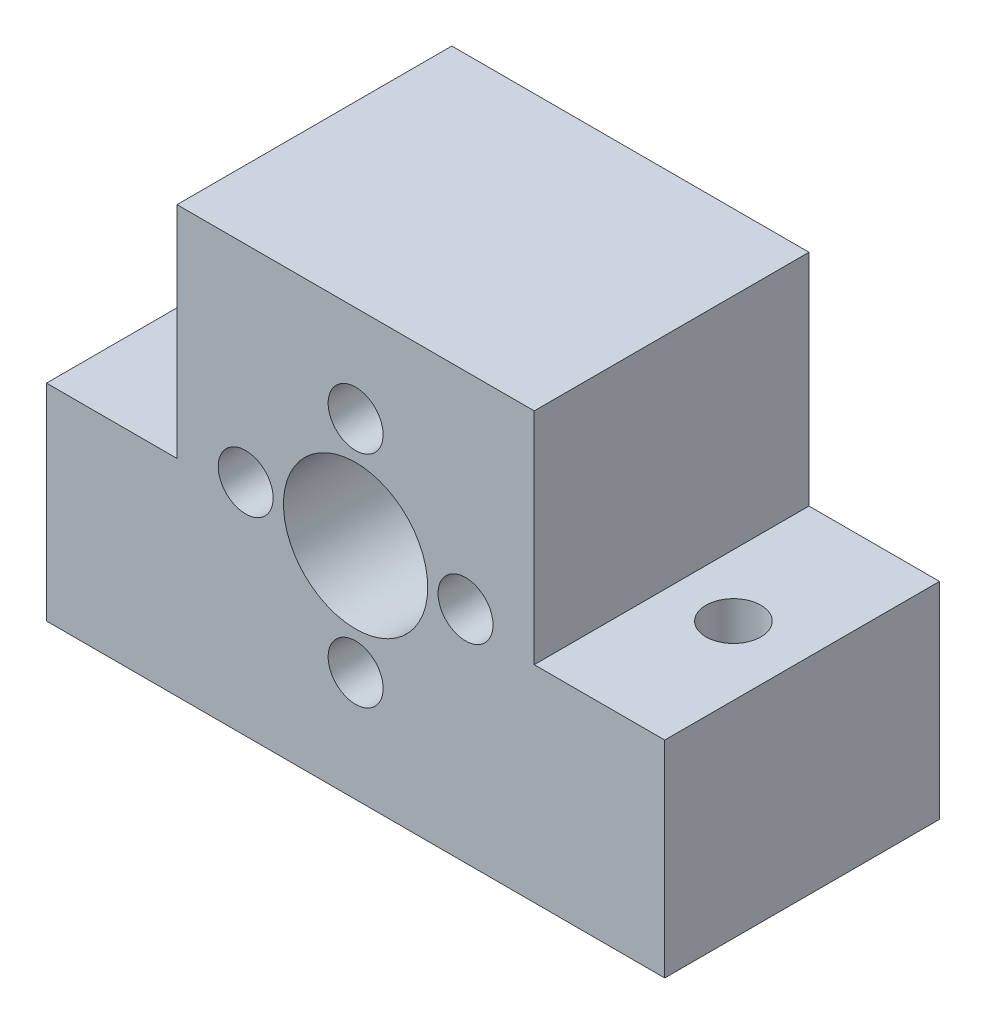
ISO-10303-21;
HEADER;
FILE_DESCRIPTION(('STEP AP214'),'2;1');
FILE_NAME('part.step','',(''),(''),'','','');
FILE_SCHEMA(('AUTOMOTIVE_DESIGN { 1 0 10303 214 1 1 1 1 }'));
ENDSEC;
DATA;
#1=APPLICATION_CONTEXT('core data for automotive mechanical design processes');
#2=APPLICATION_PROTOCOL_DEFINITION('international standard','automotive_design',2000,#1);
#3=PRODUCT_CONTEXT('',#1,'mechanical');
#4=PRODUCT('Part','Part','',(#3));
#5=PRODUCT_RELATED_PRODUCT_CATEGORY('part','',(#4));
#6=PRODUCT_DEFINITION_FORMATION('','',#4);
#7=PRODUCT_DEFINITION_CONTEXT('part definition',#1,'design');
#8=PRODUCT_DEFINITION('design','',#6,#7);
#9=PRODUCT_DEFINITION_SHAPE('','',#8);
#10=(LENGTH_UNIT() NAMED_UNIT(*) SI_UNIT(.MILLI.,.METRE.));
#11=(NAMED_UNIT(*) PLANE_ANGLE_UNIT() SI_UNIT($,.RADIAN.));
#12=(NAMED_UNIT(*) SI_UNIT($,.STERADIAN.) SOLID_ANGLE_UNIT());
#13=UNCERTAINTY_MEASURE_WITH_UNIT(LENGTH_MEASURE(1.E-05),#10,'distance_accuracy_value','');
#14=(GEOMETRIC_REPRESENTATION_CONTEXT(3) GLOBAL_UNCERTAINTY_ASSIGNED_CONTEXT((#13)) GLOBAL_UNIT_ASSIGNED_CONTEXT((#10,
#11,#12)) REPRESENTATION_CONTEXT('',''));
#15=CARTESIAN_POINT('',(0.,0.,0.));
#16=DIRECTION('',(0.,0.,1.));
#17=DIRECTION('',(1.,0.,0.));
#18=AXIS2_PLACEMENT_3D('',#15,#16,#17);
#19=CARTESIAN_POINT('',(0.,0.,20.));
#20=DIRECTION('',(0.,0.,-1.));
#21=DIRECTION('',(-1.,0.,0.));
#22=AXIS2_PLACEMENT_3D('',#19,#20,#21);
#23=PLANE('',#22);
#24=CARTESIAN_POINT('',(-8.,0.,20.));
#25=DIRECTION('',(0.,0.,1.));
#26=DIRECTION('',(1.,0.,0.));
#27=AXIS2_PLACEMENT_3D('',#24,#25,#26);
#28=CIRCLE('',#27,2.);
#29=CARTESIAN_POINT('',(-6.,0.,20.));
#30=VERTEX_POINT('',#29);
#31=EDGE_CURVE('E172',#30,#30,#28,.T.);
#32=ORIENTED_EDGE('',*,*,#31,.F.);
#33=EDGE_LOOP('',(#32));
#34=FACE_BOUND('',#33,.T.);
#35=CARTESIAN_POINT('',(0.,-8.,20.));
#36=DIRECTION('',(0.,0.,1.));
#37=DIRECTION('',(1.,0.,0.));
#38=AXIS2_PLACEMENT_3D('',#35,#36,#37);
#39=CIRCLE('',#38,2.);
#40=CARTESIAN_POINT('',(1.99999999999994,-8.,20.));
#41=VERTEX_POINT('',#40);
#42=EDGE_CURVE('E178',#41,#41,#39,.T.);
#43=ORIENTED_EDGE('',*,*,#42,.F.);
#44=EDGE_LOOP('',(#43));
#45=FACE_BOUND('',#44,.T.);
#46=CARTESIAN_POINT('',(8.,0.,20.));
#47=DIRECTION('',(0.,0.,1.));
#48=DIRECTION('',(1.,0.,0.));
#49=AXIS2_PLACEMENT_3D('',#46,#47,#48);
#50=CIRCLE('',#49,2.);
#51=CARTESIAN_POINT('',(10.,0.,20.));
#52=VERTEX_POINT('',#51);
#53=EDGE_CURVE('E184',#52,#52,#50,.T.);
#54=ORIENTED_EDGE('',*,*,#53,.F.);
#55=EDGE_LOOP('',(#54));
#56=FACE_BOUND('',#55,.T.);
#57=CARTESIAN_POINT('',(0.,8.,20.));
#58=DIRECTION('',(0.,0.,1.));
#59=DIRECTION('',(1.,0.,0.));
#60=AXIS2_PLACEMENT_3D('',#57,#58,#59);
#61=CIRCLE('',#60,2.);
#62=CARTESIAN_POINT('',(2.,8.,20.));
#63=VERTEX_POINT('',#62);
#64=EDGE_CURVE('E190',#63,#63,#61,.T.);
#65=ORIENTED_EDGE('',*,*,#64,.F.);
#66=EDGE_LOOP('',(#65));
#67=FACE_BOUND('',#66,.T.);
#68=CARTESIAN_POINT('',(0.,0.,20.));
#69=DIRECTION('',(0.,0.,1.));
#70=DIRECTION('',(1.,0.,0.));
#71=AXIS2_PLACEMENT_3D('',#68,#69,#70);
#72=CIRCLE('',#71,5.25);
#73=CARTESIAN_POINT('',(5.25,0.,20.));
#74=VERTEX_POINT('',#73);
#75=EDGE_CURVE('E131',#74,#74,#72,.T.);
#76=ORIENTED_EDGE('',*,*,#75,.F.);
#77=EDGE_LOOP('',(#76));
#78=FACE_BOUND('',#77,.T.);
#79=DIRECTION('',(1.,0.,0.));
#80=VECTOR('',#79,1.);
#81=CARTESIAN_POINT('',(0.,-1.,20.));
#82=LINE('',#81,#80);
#83=CARTESIAN_POINT('',(-22.5,-1.,20.));
#84=VERTEX_POINT('',#83);
#85=CARTESIAN_POINT('',(-13.,-1.,20.));
#86=VERTEX_POINT('',#85);
#87=EDGE_CURVE('E102',#84,#86,#82,.T.);
#88=ORIENTED_EDGE('',*,*,#87,.F.);
#89=DIRECTION('',(0.,-1.,0.));
#90=VECTOR('',#89,1.);
#91=CARTESIAN_POINT('',(-22.5,-16.,20.));
#92=LINE('',#91,#90);
#93=CARTESIAN_POINT('',(-22.5,-16.,20.));
#94=VERTEX_POINT('',#93);
#95=EDGE_CURVE('E112',#84,#94,#92,.T.);
#96=ORIENTED_EDGE('',*,*,#95,.T.);
#97=DIRECTION('',(1.,0.,0.));
#98=VECTOR('',#97,1.);
#99=CARTESIAN_POINT('',(-22.5,-16.,20.));
#100=LINE('',#99,#98);
#101=CARTESIAN_POINT('',(22.5,-16.,20.));
#102=VERTEX_POINT('',#101);
#103=EDGE_CURVE('E119',#94,#102,#100,.T.);
#104=ORIENTED_EDGE('',*,*,#103,.T.);
#105=DIRECTION('',(0.,1.,0.));
#106=VECTOR('',#105,1.);
#107=CARTESIAN_POINT('',(22.5,-16.,20.));
#108=LINE('',#107,#106);
#109=CARTESIAN_POINT('',(22.5,-1.,20.));
#110=VERTEX_POINT('',#109);
#111=EDGE_CURVE('E123',#102,#110,#108,.T.);
#112=ORIENTED_EDGE('',*,*,#111,.T.);
#113=DIRECTION('',(-1.,0.,0.));
#114=VECTOR('',#113,1.);
#115=CARTESIAN_POINT('',(0.,-1.,20.));
#116=LINE('',#115,#114);
#117=CARTESIAN_POINT('',(13.,-1.,20.));
#118=VERTEX_POINT('',#117);
#119=EDGE_CURVE('E150',#110,#118,#116,.T.);
#120=ORIENTED_EDGE('',*,*,#119,.T.);
#121=DIRECTION('',(0.,1.,0.));
#122=VECTOR('',#121,1.);
#123=CARTESIAN_POINT('',(13.,0.,20.));
#124=LINE('',#123,#122);
#125=CARTESIAN_POINT('',(13.,15.,20.));
#126=VERTEX_POINT('',#125);
#127=EDGE_CURVE('E153',#118,#126,#124,.T.);
#128=ORIENTED_EDGE('',*,*,#127,.T.);
#129=DIRECTION('',(-1.,0.,0.));
#130=VECTOR('',#129,1.);
#131=CARTESIAN_POINT('',(-22.5,15.,20.));
#132=LINE('',#131,#130);
#133=CARTESIAN_POINT('',(-13.,15.,20.));
#134=VERTEX_POINT('',#133);
#135=EDGE_CURVE('E120',#126,#134,#132,.T.);
#136=ORIENTED_EDGE('',*,*,#135,.T.);
#137=DIRECTION('',(0.,1.,0.));
#138=VECTOR('',#137,1.);
#139=CARTESIAN_POINT('',(-13.,0.,20.));
#140=LINE('',#139,#138);
#141=EDGE_CURVE('E108',#86,#134,#140,.T.);
#142=ORIENTED_EDGE('',*,*,#141,.F.);
#143=EDGE_LOOP('',(#88,#96,#104,#112,#120,#128,#136,#142));
#144=FACE_BOUND('',#143,.T.);
#145=ADVANCED_FACE('F33',(#34,#45,#56,#67,#78,#144),#23,.F.);
#146=CARTESIAN_POINT('',(0.,0.,0.));
#147=DIRECTION('',(0.,0.,-1.));
#148=DIRECTION('',(-1.,0.,0.));
#149=AXIS2_PLACEMENT_3D('',#146,#147,#148);
#150=PLANE('',#149);
#151=CARTESIAN_POINT('',(0.,-8.,0.));
#152=DIRECTION('',(0.,0.,1.));
#153=DIRECTION('',(1.,0.,0.));
#154=AXIS2_PLACEMENT_3D('',#151,#152,#153);
#155=CIRCLE('',#154,2.);
#156=CARTESIAN_POINT('',(1.99999999999994,-8.,0.));
#157=VERTEX_POINT('',#156);
#158=EDGE_CURVE('E175',#157,#157,#155,.T.);
#159=ORIENTED_EDGE('',*,*,#158,.T.);
#160=EDGE_LOOP('',(#159));
#161=FACE_BOUND('',#160,.T.);
#162=CARTESIAN_POINT('',(0.,8.,0.));
#163=DIRECTION('',(0.,0.,1.));
#164=DIRECTION('',(1.,0.,0.));
#165=AXIS2_PLACEMENT_3D('',#162,#163,#164);
#166=CIRCLE('',#165,2.);
#167=CARTESIAN_POINT('',(2.,8.,0.));
#168=VERTEX_POINT('',#167);
#169=EDGE_CURVE('E187',#168,#168,#166,.T.);
#170=ORIENTED_EDGE('',*,*,#169,.T.);
#171=EDGE_LOOP('',(#170));
#172=FACE_BOUND('',#171,.T.);
#173=CARTESIAN_POINT('',(0.,0.,0.));
#174=DIRECTION('',(0.,0.,1.));
#175=DIRECTION('',(1.,0.,0.));
#176=AXIS2_PLACEMENT_3D('',#173,#174,#175);
#177=CIRCLE('',#176,5.25);
#178=CARTESIAN_POINT('',(5.25,0.,0.));
#179=VERTEX_POINT('',#178);
#180=EDGE_CURVE('E193',#179,#179,#177,.T.);
#181=ORIENTED_EDGE('',*,*,#180,.T.);
#182=EDGE_LOOP('',(#181));
#183=FACE_BOUND('',#182,.T.);
#184=CARTESIAN_POINT('',(8.,0.,0.));
#185=DIRECTION('',(0.,0.,1.));
#186=DIRECTION('',(1.,0.,0.));
#187=AXIS2_PLACEMENT_3D('',#184,#185,#186);
#188=CIRCLE('',#187,2.);
#189=CARTESIAN_POINT('',(10.,0.,0.));
#190=VERTEX_POINT('',#189);
#191=EDGE_CURVE('E181',#190,#190,#188,.T.);
#192=ORIENTED_EDGE('',*,*,#191,.T.);
#193=EDGE_LOOP('',(#192));
#194=FACE_BOUND('',#193,.T.);
#195=CARTESIAN_POINT('',(-8.,0.,0.));
#196=DIRECTION('',(0.,0.,1.));
#197=DIRECTION('',(1.,0.,0.));
#198=AXIS2_PLACEMENT_3D('',#195,#196,#197);
#199=CIRCLE('',#198,2.);
#200=CARTESIAN_POINT('',(-6.,0.,0.));
#201=VERTEX_POINT('',#200);
#202=EDGE_CURVE('E169',#201,#201,#199,.T.);
#203=ORIENTED_EDGE('',*,*,#202,.T.);
#204=EDGE_LOOP('',(#203));
#205=FACE_BOUND('',#204,.T.);
#206=DIRECTION('',(0.,-1.,0.));
#207=VECTOR('',#206,1.);
#208=CARTESIAN_POINT('',(-22.5,-16.,0.));
#209=LINE('',#208,#207);
#210=CARTESIAN_POINT('',(-22.5,-1.,0.));
#211=VERTEX_POINT('',#210);
#212=CARTESIAN_POINT('',(-22.5,-16.,0.));
#213=VERTEX_POINT('',#212);
#214=EDGE_CURVE('E134',#211,#213,#209,.T.);
#215=ORIENTED_EDGE('',*,*,#214,.F.);
#216=DIRECTION('',(1.,0.,0.));
#217=VECTOR('',#216,1.);
#218=CARTESIAN_POINT('',(0.,-1.,0.));
#219=LINE('',#218,#217);
#220=CARTESIAN_POINT('',(-13.,-1.,0.));
#221=VERTEX_POINT('',#220);
#222=EDGE_CURVE('E58',#211,#221,#219,.T.);
#223=ORIENTED_EDGE('',*,*,#222,.T.);
#224=DIRECTION('',(0.,1.,0.));
#225=VECTOR('',#224,1.);
#226=CARTESIAN_POINT('',(-13.,0.,0.));
#227=LINE('',#226,#225);
#228=CARTESIAN_POINT('',(-13.,15.,0.));
#229=VERTEX_POINT('',#228);
#230=EDGE_CURVE('E115',#221,#229,#227,.T.);
#231=ORIENTED_EDGE('',*,*,#230,.T.);
#232=DIRECTION('',(-1.,0.,0.));
#233=VECTOR('',#232,1.);
#234=CARTESIAN_POINT('',(-22.5,15.,0.));
#235=LINE('',#234,#233);
#236=CARTESIAN_POINT('',(13.,15.,0.));
#237=VERTEX_POINT('',#236);
#238=EDGE_CURVE('E130',#237,#229,#235,.T.);
#239=ORIENTED_EDGE('',*,*,#238,.F.);
#240=DIRECTION('',(0.,1.,0.));
#241=VECTOR('',#240,1.);
#242=CARTESIAN_POINT('',(13.,0.,0.));
#243=LINE('',#242,#241);
#244=CARTESIAN_POINT('',(13.,-1.,0.));
#245=VERTEX_POINT('',#244);
#246=EDGE_CURVE('E50',#245,#237,#243,.T.);
#247=ORIENTED_EDGE('',*,*,#246,.F.);
#248=DIRECTION('',(-1.,0.,0.));
#249=VECTOR('',#248,1.);
#250=CARTESIAN_POINT('',(0.,-1.,0.));
#251=LINE('',#250,#249);
#252=CARTESIAN_POINT('',(22.5,-1.,0.));
#253=VERTEX_POINT('',#252);
#254=EDGE_CURVE('E157',#253,#245,#251,.T.);
#255=ORIENTED_EDGE('',*,*,#254,.F.);
#256=DIRECTION('',(0.,1.,0.));
#257=VECTOR('',#256,1.);
#258=CARTESIAN_POINT('',(22.5,-16.,0.));
#259=LINE('',#258,#257);
#260=CARTESIAN_POINT('',(22.5,-16.,0.));
#261=VERTEX_POINT('',#260);
#262=EDGE_CURVE('E127',#261,#253,#259,.T.);
#263=ORIENTED_EDGE('',*,*,#262,.F.);
#264=DIRECTION('',(1.,0.,0.));
#265=VECTOR('',#264,1.);
#266=CARTESIAN_POINT('',(-22.5,-16.,0.));
#267=LINE('',#266,#265);
#268=EDGE_CURVE('E136',#213,#261,#267,.T.);
#269=ORIENTED_EDGE('',*,*,#268,.F.);
#270=EDGE_LOOP('',(#215,#223,#231,#239,#247,#255,#263,#269));
#271=FACE_BOUND('',#270,.T.);
#272=ADVANCED_FACE('F210',(#161,#172,#183,#194,#205,#271),#150,.T.);
#273=CARTESIAN_POINT('',(-22.5,15.,20.));
#274=DIRECTION('',(0.,-1.,0.));
#275=DIRECTION('',(0.,0.,-1.));
#276=AXIS2_PLACEMENT_3D('',#273,#274,#275);
#277=PLANE('',#276);
#278=DIRECTION('',(0.,0.,-1.));
#279=VECTOR('',#278,1.);
#280=CARTESIAN_POINT('',(-13.,15.,20.));
#281=LINE('',#280,#279);
#282=EDGE_CURVE('E107',#134,#229,#281,.T.);
#283=ORIENTED_EDGE('',*,*,#282,.F.);
#284=ORIENTED_EDGE('',*,*,#135,.F.);
#285=DIRECTION('',(0.,0.,-1.));
#286=VECTOR('',#285,1.);
#287=CARTESIAN_POINT('',(13.,15.,20.));
#288=LINE('',#287,#286);
#289=EDGE_CURVE('E163',#126,#237,#288,.T.);
#290=ORIENTED_EDGE('',*,*,#289,.T.);
#291=ORIENTED_EDGE('',*,*,#238,.T.);
#292=EDGE_LOOP('',(#283,#284,#290,#291));
#293=FACE_BOUND('',#292,.T.);
#294=ADVANCED_FACE('F216',(#293),#277,.F.);
#295=CARTESIAN_POINT('',(-22.5,-16.,20.));
#296=DIRECTION('',(1.,0.,0.));
#297=DIRECTION('',(0.,0.,-1.));
#298=AXIS2_PLACEMENT_3D('',#295,#296,#297);
#299=PLANE('',#298);
#300=DIRECTION('',(0.,0.,-1.));
#301=VECTOR('',#300,1.);
#302=CARTESIAN_POINT('',(-22.5,-1.,20.));
#303=LINE('',#302,#301);
#304=EDGE_CURVE('E98',#84,#211,#303,.T.);
#305=ORIENTED_EDGE('',*,*,#304,.T.);
#306=ORIENTED_EDGE('',*,*,#214,.T.);
#307=DIRECTION('',(0.,0.,-1.));
#308=VECTOR('',#307,1.);
#309=CARTESIAN_POINT('',(-22.5,-16.,20.));
#310=LINE('',#309,#308);
#311=EDGE_CURVE('E11',#94,#213,#310,.T.);
#312=ORIENTED_EDGE('',*,*,#311,.F.);
#313=ORIENTED_EDGE('',*,*,#95,.F.);
#314=EDGE_LOOP('',(#305,#306,#312,#313));
#315=FACE_BOUND('',#314,.T.);
#316=ADVANCED_FACE('F117',(#315),#299,.F.);
#317=CARTESIAN_POINT('',(-17.5,-16.,10.));
#318=DIRECTION('',(0.,1.,0.));
#319=DIRECTION('',(0.,0.,1.));
#320=AXIS2_PLACEMENT_3D('',#317,#318,#319);
#321=CYLINDRICAL_SURFACE('',#320,2.);
#322=CARTESIAN_POINT('',(-17.5,-16.,10.));
#323=DIRECTION('',(0.,1.,0.));
#324=DIRECTION('',(0.,0.,1.));
#325=AXIS2_PLACEMENT_3D('',#322,#323,#324);
#326=CIRCLE('',#325,2.);
#327=CARTESIAN_POINT('',(-17.5,-16.,12.));
#328=VERTEX_POINT('',#327);
#329=EDGE_CURVE('E166',#328,#328,#326,.T.);
#330=ORIENTED_EDGE('',*,*,#329,.F.);
#331=EDGE_LOOP('',(#330));
#332=FACE_BOUND('',#331,.T.);
#333=CARTESIAN_POINT('',(-17.5,-1.,10.));
#334=DIRECTION('',(0.,1.,0.));
#335=DIRECTION('',(0.,0.,1.));
#336=AXIS2_PLACEMENT_3D('',#333,#334,#335);
#337=CIRCLE('',#336,2.);
#338=CARTESIAN_POINT('',(-17.5,-1.,12.));
#339=VERTEX_POINT('',#338);
#340=EDGE_CURVE('E139',#339,#339,#337,.F.);
#341=ORIENTED_EDGE('',*,*,#340,.F.);
#342=EDGE_LOOP('',(#341));
#343=FACE_BOUND('',#342,.T.);
#344=ADVANCED_FACE('F247',(#332,#343),#321,.F.);
#345=CARTESIAN_POINT('',(22.5,-16.,20.));
#346=DIRECTION('',(-1.,0.,0.));
#347=DIRECTION('',(0.,0.,1.));
#348=AXIS2_PLACEMENT_3D('',#345,#346,#347);
#349=PLANE('',#348);
#350=ORIENTED_EDGE('',*,*,#262,.T.);
#351=DIRECTION('',(0.,0.,-1.));
#352=VECTOR('',#351,1.);
#353=CARTESIAN_POINT('',(22.5,-1.,20.));
#354=LINE('',#353,#352);
#355=EDGE_CURVE('E161',#110,#253,#354,.T.);
#356=ORIENTED_EDGE('',*,*,#355,.F.);
#357=ORIENTED_EDGE('',*,*,#111,.F.);
#358=DIRECTION('',(0.,0.,-1.));
#359=VECTOR('',#358,1.);
#360=CARTESIAN_POINT('',(22.5,-16.,20.));
#361=LINE('',#360,#359);
#362=EDGE_CURVE('E42',#102,#261,#361,.T.);
#363=ORIENTED_EDGE('',*,*,#362,.T.);
#364=EDGE_LOOP('',(#350,#356,#357,#363));
#365=FACE_BOUND('',#364,.T.);
#366=ADVANCED_FACE('F35',(#365),#349,.F.);
#367=CARTESIAN_POINT('',(-22.5,-16.,20.));
#368=DIRECTION('',(0.,1.,0.));
#369=DIRECTION('',(-1.,0.,0.));
#370=AXIS2_PLACEMENT_3D('',#367,#368,#369);
#371=PLANE('',#370);
#372=ORIENTED_EDGE('',*,*,#329,.T.);
#373=EDGE_LOOP('',(#372));
#374=FACE_BOUND('',#373,.T.);
#375=CARTESIAN_POINT('',(17.5,-16.,10.));
#376=DIRECTION('',(0.,1.,0.));
#377=DIRECTION('',(0.,0.,-1.));
#378=AXIS2_PLACEMENT_3D('',#375,#376,#377);
#379=CIRCLE('',#378,2.);
#380=CARTESIAN_POINT('',(17.5,-16.,8.));
#381=VERTEX_POINT('',#380);
#382=EDGE_CURVE('E144',#381,#381,#379,.T.);
#383=ORIENTED_EDGE('',*,*,#382,.T.);
#384=EDGE_LOOP('',(#383));
#385=FACE_BOUND('',#384,.T.);
#386=ORIENTED_EDGE('',*,*,#268,.T.);
#387=ORIENTED_EDGE('',*,*,#362,.F.);
#388=ORIENTED_EDGE('',*,*,#103,.F.);
#389=ORIENTED_EDGE('',*,*,#311,.T.);
#390=EDGE_LOOP('',(#386,#387,#388,#389));
#391=FACE_BOUND('',#390,.T.);
#392=ADVANCED_FACE('F242',(#374,#385,#391),#371,.F.);
#393=CARTESIAN_POINT('',(0.,0.,20.));
#394=DIRECTION('',(0.,0.,-1.));
#395=DIRECTION('',(-1.,0.,0.));
#396=AXIS2_PLACEMENT_3D('',#393,#394,#395);
#397=CYLINDRICAL_SURFACE('',#396,5.25);
#398=ORIENTED_EDGE('',*,*,#75,.T.);
#399=EDGE_LOOP('',(#398));
#400=FACE_BOUND('',#399,.T.);
#401=ORIENTED_EDGE('',*,*,#180,.F.);
#402=EDGE_LOOP('',(#401));
#403=FACE_BOUND('',#402,.T.);
#404=ADVANCED_FACE('F239',(#400,#403),#397,.F.);
#405=CARTESIAN_POINT('',(0.,8.,20.));
#406=DIRECTION('',(0.,0.,-1.));
#407=DIRECTION('',(-1.,0.,0.));
#408=AXIS2_PLACEMENT_3D('',#405,#406,#407);
#409=CYLINDRICAL_SURFACE('',#408,2.);
#410=ORIENTED_EDGE('',*,*,#64,.T.);
#411=EDGE_LOOP('',(#410));
#412=FACE_BOUND('',#411,.T.);
#413=ORIENTED_EDGE('',*,*,#169,.F.);
#414=EDGE_LOOP('',(#413));
#415=FACE_BOUND('',#414,.T.);
#416=ADVANCED_FACE('F281',(#412,#415),#409,.F.);
#417=CARTESIAN_POINT('',(8.,0.,20.));
#418=DIRECTION('',(0.,0.,-1.));
#419=DIRECTION('',(-1.,0.,0.));
#420=AXIS2_PLACEMENT_3D('',#417,#418,#419);
#421=CYLINDRICAL_SURFACE('',#420,2.);
#422=ORIENTED_EDGE('',*,*,#53,.T.);
#423=EDGE_LOOP('',(#422));
#424=FACE_BOUND('',#423,.T.);
#425=ORIENTED_EDGE('',*,*,#191,.F.);
#426=EDGE_LOOP('',(#425));
#427=FACE_BOUND('',#426,.T.);
#428=ADVANCED_FACE('F288',(#424,#427),#421,.F.);
#429=CARTESIAN_POINT('',(0.,-8.,20.));
#430=DIRECTION('',(0.,0.,-1.));
#431=DIRECTION('',(-1.,0.,0.));
#432=AXIS2_PLACEMENT_3D('',#429,#430,#431);
#433=CYLINDRICAL_SURFACE('',#432,2.);
#434=ORIENTED_EDGE('',*,*,#42,.T.);
#435=EDGE_LOOP('',(#434));
#436=FACE_BOUND('',#435,.T.);
#437=ORIENTED_EDGE('',*,*,#158,.F.);
#438=EDGE_LOOP('',(#437));
#439=FACE_BOUND('',#438,.T.);
#440=ADVANCED_FACE('F295',(#436,#439),#433,.F.);
#441=CARTESIAN_POINT('',(-8.,0.,20.));
#442=DIRECTION('',(0.,0.,-1.));
#443=DIRECTION('',(-1.,0.,0.));
#444=AXIS2_PLACEMENT_3D('',#441,#442,#443);
#445=CYLINDRICAL_SURFACE('',#444,2.);
#446=ORIENTED_EDGE('',*,*,#31,.T.);
#447=EDGE_LOOP('',(#446));
#448=FACE_BOUND('',#447,.T.);
#449=ORIENTED_EDGE('',*,*,#202,.F.);
#450=EDGE_LOOP('',(#449));
#451=FACE_BOUND('',#450,.T.);
#452=ADVANCED_FACE('F303',(#448,#451),#445,.F.);
#453=CARTESIAN_POINT('',(17.5,-16.,10.));
#454=DIRECTION('',(0.,1.,0.));
#455=DIRECTION('',(0.,0.,1.));
#456=AXIS2_PLACEMENT_3D('',#453,#454,#455);
#457=CYLINDRICAL_SURFACE('',#456,2.);
#458=CARTESIAN_POINT('',(17.5,-1.,10.));
#459=DIRECTION('',(0.,-1.,0.));
#460=DIRECTION('',(0.,0.,-1.));
#461=AXIS2_PLACEMENT_3D('',#458,#459,#460);
#462=CIRCLE('',#461,2.);
#463=CARTESIAN_POINT('',(17.5,-1.,8.));
#464=VERTEX_POINT('',#463);
#465=EDGE_CURVE('E37',#464,#464,#462,.F.);
#466=ORIENTED_EDGE('',*,*,#465,.T.);
#467=EDGE_LOOP('',(#466));
#468=FACE_BOUND('',#467,.T.);
#469=ORIENTED_EDGE('',*,*,#382,.F.);
#470=EDGE_LOOP('',(#469));
#471=FACE_BOUND('',#470,.T.);
#472=ADVANCED_FACE('F310',(#468,#471),#457,.F.);
#473=CARTESIAN_POINT('',(0.,-1.,20.));
#474=DIRECTION('',(0.,1.,0.));
#475=DIRECTION('',(0.,0.,1.));
#476=AXIS2_PLACEMENT_3D('',#473,#474,#475);
#477=PLANE('',#476);
#478=ORIENTED_EDGE('',*,*,#222,.F.);
#479=ORIENTED_EDGE('',*,*,#304,.F.);
#480=ORIENTED_EDGE('',*,*,#87,.T.);
#481=DIRECTION('',(0.,0.,-1.));
#482=VECTOR('',#481,1.);
#483=CARTESIAN_POINT('',(-13.,-1.,20.));
#484=LINE('',#483,#482);
#485=EDGE_CURVE('E141',#86,#221,#484,.T.);
#486=ORIENTED_EDGE('',*,*,#485,.T.);
#487=EDGE_LOOP('',(#478,#479,#480,#486));
#488=FACE_BOUND('',#487,.T.);
#489=ORIENTED_EDGE('',*,*,#340,.T.);
#490=EDGE_LOOP('',(#489));
#491=FACE_BOUND('',#490,.T.);
#492=ADVANCED_FACE('F100',(#488,#491),#477,.T.);
#493=CARTESIAN_POINT('',(-13.,0.,20.));
#494=DIRECTION('',(-1.,0.,0.));
#495=DIRECTION('',(0.,-1.,0.));
#496=AXIS2_PLACEMENT_3D('',#493,#494,#495);
#497=PLANE('',#496);
#498=ORIENTED_EDGE('',*,*,#230,.F.);
#499=ORIENTED_EDGE('',*,*,#485,.F.);
#500=ORIENTED_EDGE('',*,*,#141,.T.);
#501=ORIENTED_EDGE('',*,*,#282,.T.);
#502=EDGE_LOOP('',(#498,#499,#500,#501));
#503=FACE_BOUND('',#502,.T.);
#504=ADVANCED_FACE('F225',(#503),#497,.T.);
#505=CARTESIAN_POINT('',(0.,-1.,20.));
#506=DIRECTION('',(0.,-1.,0.));
#507=DIRECTION('',(0.,0.,-1.));
#508=AXIS2_PLACEMENT_3D('',#505,#506,#507);
#509=PLANE('',#508);
#510=ORIENTED_EDGE('',*,*,#254,.T.);
#511=DIRECTION('',(0.,0.,-1.));
#512=VECTOR('',#511,1.);
#513=CARTESIAN_POINT('',(13.,-1.,20.));
#514=LINE('',#513,#512);
#515=EDGE_CURVE('E156',#118,#245,#514,.T.);
#516=ORIENTED_EDGE('',*,*,#515,.F.);
#517=ORIENTED_EDGE('',*,*,#119,.F.);
#518=ORIENTED_EDGE('',*,*,#355,.T.);
#519=EDGE_LOOP('',(#510,#516,#517,#518));
#520=FACE_BOUND('',#519,.T.);
#521=ORIENTED_EDGE('',*,*,#465,.F.);
#522=EDGE_LOOP('',(#521));
#523=FACE_BOUND('',#522,.T.);
#524=ADVANCED_FACE('F207',(#520,#523),#509,.F.);
#525=CARTESIAN_POINT('',(13.,0.,20.));
#526=DIRECTION('',(-1.,0.,0.));
#527=DIRECTION('',(0.,-1.,0.));
#528=AXIS2_PLACEMENT_3D('',#525,#526,#527);
#529=PLANE('',#528);
#530=ORIENTED_EDGE('',*,*,#246,.T.);
#531=ORIENTED_EDGE('',*,*,#289,.F.);
#532=ORIENTED_EDGE('',*,*,#127,.F.);
#533=ORIENTED_EDGE('',*,*,#515,.T.);
#534=EDGE_LOOP('',(#530,#531,#532,#533));
#535=FACE_BOUND('',#534,.T.);
#536=ADVANCED_FACE('F219',(#535),#529,.F.);
#537=CLOSED_SHELL('',(#145,#272,#294,#316,#344,#366,#392,#404,#416,#428,#440,#452,#472,#492,
#504,#524,#536));
#538=MANIFOLD_SOLID_BREP('B2',#537);
#539=ADVANCED_BREP_SHAPE_REPRESENTATION('',(#18,#538),#14);
#540=SHAPE_DEFINITION_REPRESENTATION(#9,#539);
ENDSEC;
END-ISO-10303-21;
